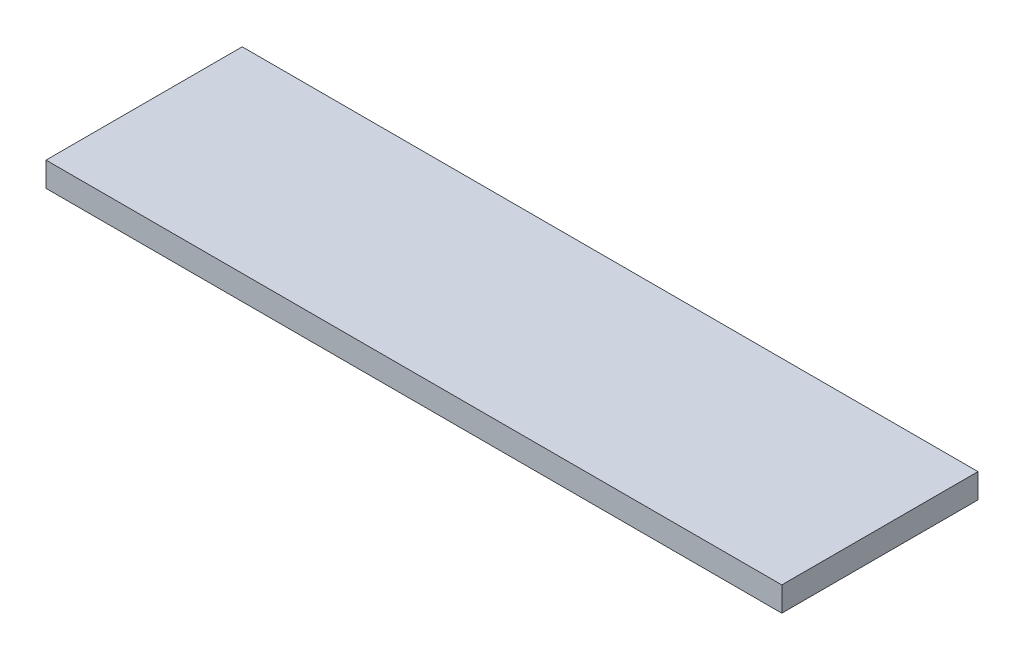
ISO-10303-21;
HEADER;
FILE_DESCRIPTION(('STEP AP214'),'2;1');
FILE_NAME('part.step','',(''),(''),'','','');
FILE_SCHEMA(('AUTOMOTIVE_DESIGN { 1 0 10303 214 1 1 1 1 }'));
ENDSEC;
DATA;
#1=APPLICATION_CONTEXT('core data for automotive mechanical design processes');
#2=APPLICATION_PROTOCOL_DEFINITION('international standard','automotive_design',2000,#1);
#3=PRODUCT_CONTEXT('',#1,'mechanical');
#4=PRODUCT('Part','Part','',(#3));
#5=PRODUCT_RELATED_PRODUCT_CATEGORY('part','',(#4));
#6=PRODUCT_DEFINITION_FORMATION('','',#4);
#7=PRODUCT_DEFINITION_CONTEXT('part definition',#1,'design');
#8=PRODUCT_DEFINITION('design','',#6,#7);
#9=PRODUCT_DEFINITION_SHAPE('','',#8);
#10=(LENGTH_UNIT() NAMED_UNIT(*) SI_UNIT(.MILLI.,.METRE.));
#11=(NAMED_UNIT(*) PLANE_ANGLE_UNIT() SI_UNIT($,.RADIAN.));
#12=(NAMED_UNIT(*) SI_UNIT($,.STERADIAN.) SOLID_ANGLE_UNIT());
#13=UNCERTAINTY_MEASURE_WITH_UNIT(LENGTH_MEASURE(1.E-05),#10,'distance_accuracy_value','');
#14=(GEOMETRIC_REPRESENTATION_CONTEXT(3) GLOBAL_UNCERTAINTY_ASSIGNED_CONTEXT((#13)) GLOBAL_UNIT_ASSIGNED_CONTEXT((#10,
#11,#12)) REPRESENTATION_CONTEXT('',''));
#15=CARTESIAN_POINT('',(0.,0.,0.));
#16=DIRECTION('',(0.,0.,1.));
#17=DIRECTION('',(1.,0.,0.));
#18=AXIS2_PLACEMENT_3D('',#15,#16,#17);
#19=CARTESIAN_POINT('',(0.,-231.335501283086,40.));
#20=DIRECTION('',(0.,-1.,0.));
#21=DIRECTION('',(0.,0.,-1.));
#22=AXIS2_PLACEMENT_3D('',#19,#20,#21);
#23=PLANE('',#22);
#24=DIRECTION('',(-1.,0.,0.));
#25=VECTOR('',#24,1.);
#26=CARTESIAN_POINT('',(0.,-231.335501283086,0.));
#27=LINE('',#26,#25);
#28=CARTESIAN_POINT('',(83.357276159563,-231.335501283086,0.));
#29=VERTEX_POINT('',#28);
#30=CARTESIAN_POINT('',(-66.6427238404366,-231.335501283086,0.));
#31=VERTEX_POINT('',#30);
#32=EDGE_CURVE('E100',#29,#31,#27,.T.);
#33=ORIENTED_EDGE('',*,*,#32,.T.);
#34=DIRECTION('',(0.,0.,-1.));
#35=VECTOR('',#34,1.);
#36=CARTESIAN_POINT('',(-66.6427238404366,-231.335501283086,40.));
#37=LINE('',#36,#35);
#38=CARTESIAN_POINT('',(-66.6427238404366,-231.335501283086,40.));
#39=VERTEX_POINT('',#38);
#40=EDGE_CURVE('E11',#39,#31,#37,.T.);
#41=ORIENTED_EDGE('',*,*,#40,.F.);
#42=DIRECTION('',(-1.,0.,0.));
#43=VECTOR('',#42,1.);
#44=CARTESIAN_POINT('',(0.,-231.335501283086,40.));
#45=LINE('',#44,#43);
#46=CARTESIAN_POINT('',(83.357276159563,-231.335501283086,40.));
#47=VERTEX_POINT('',#46);
#48=EDGE_CURVE('E86',#47,#39,#45,.T.);
#49=ORIENTED_EDGE('',*,*,#48,.F.);
#50=DIRECTION('',(0.,0.,-1.));
#51=VECTOR('',#50,1.);
#52=CARTESIAN_POINT('',(83.357276159563,-231.335501283086,40.));
#53=LINE('',#52,#51);
#54=EDGE_CURVE('E53',#47,#29,#53,.T.);
#55=ORIENTED_EDGE('',*,*,#54,.T.);
#56=EDGE_LOOP('',(#33,#41,#49,#55));
#57=FACE_BOUND('',#56,.T.);
#58=ADVANCED_FACE('F37',(#57),#23,.F.);
#59=CARTESIAN_POINT('',(-66.6427238404289,2.21964859294139E-12,40.));
#60=DIRECTION('',(1.,0.,0.));
#61=DIRECTION('',(0.,1.,0.));
#62=AXIS2_PLACEMENT_3D('',#59,#60,#61);
#63=PLANE('',#62);
#64=DIRECTION('',(0.,-1.,0.));
#65=VECTOR('',#64,1.);
#66=CARTESIAN_POINT('',(-66.6427238404289,2.21964859294139E-12,0.));
#67=LINE('',#66,#65);
#68=CARTESIAN_POINT('',(-66.6427238404368,-236.335501283086,0.));
#69=VERTEX_POINT('',#68);
#70=EDGE_CURVE('E91',#31,#69,#67,.T.);
#71=ORIENTED_EDGE('',*,*,#70,.T.);
#72=DIRECTION('',(0.,0.,-1.));
#73=VECTOR('',#72,1.);
#74=CARTESIAN_POINT('',(-66.6427238404368,-236.335501283086,40.));
#75=LINE('',#74,#73);
#76=CARTESIAN_POINT('',(-66.6427238404368,-236.335501283086,40.));
#77=VERTEX_POINT('',#76);
#78=EDGE_CURVE('E45',#77,#69,#75,.T.);
#79=ORIENTED_EDGE('',*,*,#78,.F.);
#80=DIRECTION('',(0.,-1.,0.));
#81=VECTOR('',#80,1.);
#82=CARTESIAN_POINT('',(-66.6427238404289,2.21964859294139E-12,40.));
#83=LINE('',#82,#81);
#84=EDGE_CURVE('E78',#39,#77,#83,.T.);
#85=ORIENTED_EDGE('',*,*,#84,.F.);
#86=ORIENTED_EDGE('',*,*,#40,.T.);
#87=EDGE_LOOP('',(#71,#79,#85,#86));
#88=FACE_BOUND('',#87,.T.);
#89=ADVANCED_FACE('F90',(#88),#63,.F.);
#90=CARTESIAN_POINT('',(0.,-236.335501283086,40.));
#91=DIRECTION('',(0.,-1.,0.));
#92=DIRECTION('',(1.,0.,0.));
#93=AXIS2_PLACEMENT_3D('',#90,#91,#92);
#94=PLANE('',#93);
#95=DIRECTION('',(-1.,0.,0.));
#96=VECTOR('',#95,1.);
#97=CARTESIAN_POINT('',(0.,-236.335501283086,0.));
#98=LINE('',#97,#96);
#99=CARTESIAN_POINT('',(83.3572761595632,-236.335501283086,0.));
#100=VERTEX_POINT('',#99);
#101=EDGE_CURVE('E103',#100,#69,#98,.T.);
#102=ORIENTED_EDGE('',*,*,#101,.F.);
#103=DIRECTION('',(0.,0.,-1.));
#104=VECTOR('',#103,1.);
#105=CARTESIAN_POINT('',(83.3572761595632,-236.335501283086,40.));
#106=LINE('',#105,#104);
#107=CARTESIAN_POINT('',(83.3572761595632,-236.335501283086,40.));
#108=VERTEX_POINT('',#107);
#109=EDGE_CURVE('E67',#108,#100,#106,.T.);
#110=ORIENTED_EDGE('',*,*,#109,.F.);
#111=DIRECTION('',(-1.,0.,0.));
#112=VECTOR('',#111,1.);
#113=CARTESIAN_POINT('',(0.,-236.335501283086,40.));
#114=LINE('',#113,#112);
#115=EDGE_CURVE('E85',#108,#77,#114,.T.);
#116=ORIENTED_EDGE('',*,*,#115,.T.);
#117=ORIENTED_EDGE('',*,*,#78,.T.);
#118=EDGE_LOOP('',(#102,#110,#116,#117));
#119=FACE_BOUND('',#118,.T.);
#120=ADVANCED_FACE('F94',(#119),#94,.T.);
#121=CARTESIAN_POINT('',(83.3572761595547,3.00771793602719E-12,40.));
#122=DIRECTION('',(1.,0.,0.));
#123=DIRECTION('',(0.,1.,0.));
#124=AXIS2_PLACEMENT_3D('',#121,#122,#123);
#125=PLANE('',#124);
#126=DIRECTION('',(0.,-1.,0.));
#127=VECTOR('',#126,1.);
#128=CARTESIAN_POINT('',(83.3572761595547,3.00771793602719E-12,0.));
#129=LINE('',#128,#127);
#130=EDGE_CURVE('E105',#29,#100,#129,.T.);
#131=ORIENTED_EDGE('',*,*,#130,.F.);
#132=ORIENTED_EDGE('',*,*,#54,.F.);
#133=DIRECTION('',(0.,-1.,0.));
#134=VECTOR('',#133,1.);
#135=CARTESIAN_POINT('',(83.3572761595547,3.00771793602719E-12,40.));
#136=LINE('',#135,#134);
#137=EDGE_CURVE('E95',#47,#108,#136,.T.);
#138=ORIENTED_EDGE('',*,*,#137,.T.);
#139=ORIENTED_EDGE('',*,*,#109,.T.);
#140=EDGE_LOOP('',(#131,#132,#138,#139));
#141=FACE_BOUND('',#140,.T.);
#142=ADVANCED_FACE('F111',(#141),#125,.T.);
#143=CARTESIAN_POINT('',(0.,0.,40.));
#144=DIRECTION('',(0.,0.,1.));
#145=DIRECTION('',(1.,0.,0.));
#146=AXIS2_PLACEMENT_3D('',#143,#144,#145);
#147=PLANE('',#146);
#148=ORIENTED_EDGE('',*,*,#48,.T.);
#149=ORIENTED_EDGE('',*,*,#84,.T.);
#150=ORIENTED_EDGE('',*,*,#115,.F.);
#151=ORIENTED_EDGE('',*,*,#137,.F.);
#152=EDGE_LOOP('',(#148,#149,#150,#151));
#153=FACE_BOUND('',#152,.T.);
#154=ADVANCED_FACE('F82',(#153),#147,.T.);
#155=CARTESIAN_POINT('',(0.,0.,0.));
#156=DIRECTION('',(0.,0.,1.));
#157=DIRECTION('',(1.,0.,0.));
#158=AXIS2_PLACEMENT_3D('',#155,#156,#157);
#159=PLANE('',#158);
#160=ORIENTED_EDGE('',*,*,#32,.F.);
#161=ORIENTED_EDGE('',*,*,#130,.T.);
#162=ORIENTED_EDGE('',*,*,#101,.T.);
#163=ORIENTED_EDGE('',*,*,#70,.F.);
#164=EDGE_LOOP('',(#160,#161,#162,#163));
#165=FACE_BOUND('',#164,.T.);
#166=ADVANCED_FACE('F110',(#165),#159,.F.);
#167=CLOSED_SHELL('',(#58,#89,#120,#142,#154,#166));
#168=MANIFOLD_SOLID_BREP('B2',#167);
#169=ADVANCED_BREP_SHAPE_REPRESENTATION('',(#18,#168),#14);
#170=SHAPE_DEFINITION_REPRESENTATION(#9,#169);
ENDSEC;
END-ISO-10303-21;
